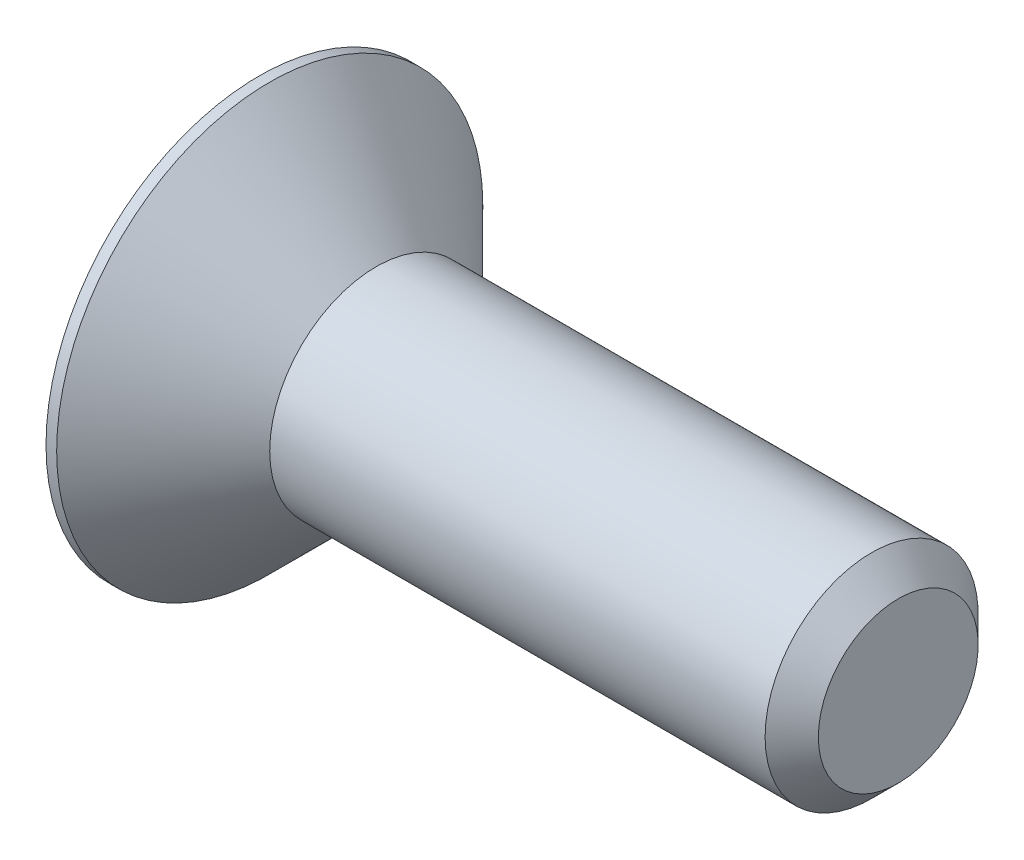
ISO-10303-21;
HEADER;
FILE_DESCRIPTION(('STEP AP214'),'2;1');
FILE_NAME('part.step','',(''),(''),'','','');
FILE_SCHEMA(('AUTOMOTIVE_DESIGN { 1 0 10303 214 1 1 1 1 }'));
ENDSEC;
DATA;
#1=APPLICATION_CONTEXT('core data for automotive mechanical design processes');
#2=APPLICATION_PROTOCOL_DEFINITION('international standard','automotive_design',2000,#1);
#3=PRODUCT_CONTEXT('',#1,'mechanical');
#4=PRODUCT('Part','Part','',(#3));
#5=PRODUCT_RELATED_PRODUCT_CATEGORY('part','',(#4));
#6=PRODUCT_DEFINITION_FORMATION('','',#4);
#7=PRODUCT_DEFINITION_CONTEXT('part definition',#1,'design');
#8=PRODUCT_DEFINITION('design','',#6,#7);
#9=PRODUCT_DEFINITION_SHAPE('','',#8);
#10=(LENGTH_UNIT() NAMED_UNIT(*) SI_UNIT(.MILLI.,.METRE.));
#11=(NAMED_UNIT(*) PLANE_ANGLE_UNIT() SI_UNIT($,.RADIAN.));
#12=(NAMED_UNIT(*) SI_UNIT($,.STERADIAN.) SOLID_ANGLE_UNIT());
#13=UNCERTAINTY_MEASURE_WITH_UNIT(LENGTH_MEASURE(1.E-05),#10,'distance_accuracy_value','');
#14=(GEOMETRIC_REPRESENTATION_CONTEXT(3) GLOBAL_UNCERTAINTY_ASSIGNED_CONTEXT((#13)) GLOBAL_UNIT_ASSIGNED_CONTEXT((#10,
#11,#12)) REPRESENTATION_CONTEXT('',''));
#15=CARTESIAN_POINT('',(0.,0.,0.));
#16=DIRECTION('',(0.,0.,1.));
#17=DIRECTION('',(1.,0.,0.));
#18=AXIS2_PLACEMENT_3D('',#15,#16,#17);
#19=CARTESIAN_POINT('',(0.,0.,0.));
#20=DIRECTION('',(1.,0.,0.));
#21=DIRECTION('',(0.,0.,-1.));
#22=AXIS2_PLACEMENT_3D('',#19,#20,#21);
#23=PLANE('',#22);
#24=DIRECTION('',(0.,0.866025403784439,0.5));
#25=VECTOR('',#24,1.);
#26=CARTESIAN_POINT('',(0.,-0.75,0.433012701892219));
#27=LINE('',#26,#25);
#28=CARTESIAN_POINT('',(0.,-0.75,0.433012701892219));
#29=VERTEX_POINT('',#28);
#30=CARTESIAN_POINT('',(0.,0.,0.866025403784438));
#31=VERTEX_POINT('',#30);
#32=EDGE_CURVE('E122',#29,#31,#27,.T.);
#33=ORIENTED_EDGE('',*,*,#32,.F.);
#34=DIRECTION('',(0.,0.,1.));
#35=VECTOR('',#34,1.);
#36=CARTESIAN_POINT('',(0.,-0.75,-0.43301270189222));
#37=LINE('',#36,#35);
#38=CARTESIAN_POINT('',(0.,-0.75,-0.43301270189222));
#39=VERTEX_POINT('',#38);
#40=EDGE_CURVE('E48',#39,#29,#37,.T.);
#41=ORIENTED_EDGE('',*,*,#40,.F.);
#42=DIRECTION('',(0.,-0.866025403784439,0.5));
#43=VECTOR('',#42,1.);
#44=CARTESIAN_POINT('',(0.,0.,-0.866025403784439));
#45=LINE('',#44,#43);
#46=CARTESIAN_POINT('',(0.,0.,-0.866025403784439));
#47=VERTEX_POINT('',#46);
#48=EDGE_CURVE('E131',#47,#39,#45,.T.);
#49=ORIENTED_EDGE('',*,*,#48,.F.);
#50=DIRECTION('',(0.,-0.866025403784439,-0.5));
#51=VECTOR('',#50,1.);
#52=CARTESIAN_POINT('',(0.,0.75,-0.43301270189222));
#53=LINE('',#52,#51);
#54=CARTESIAN_POINT('',(0.,0.75,-0.43301270189222));
#55=VERTEX_POINT('',#54);
#56=EDGE_CURVE('E129',#55,#47,#53,.T.);
#57=ORIENTED_EDGE('',*,*,#56,.F.);
#58=DIRECTION('',(0.,0.,-1.));
#59=VECTOR('',#58,1.);
#60=CARTESIAN_POINT('',(0.,0.75,0.433012701892219));
#61=LINE('',#60,#59);
#62=CARTESIAN_POINT('',(0.,0.75,0.433012701892219));
#63=VERTEX_POINT('',#62);
#64=EDGE_CURVE('E96',#63,#55,#61,.T.);
#65=ORIENTED_EDGE('',*,*,#64,.F.);
#66=DIRECTION('',(0.,0.866025403784439,-0.5));
#67=VECTOR('',#66,1.);
#68=CARTESIAN_POINT('',(0.,0.,0.866025403784438));
#69=LINE('',#68,#67);
#70=EDGE_CURVE('E125',#31,#63,#69,.T.);
#71=ORIENTED_EDGE('',*,*,#70,.F.);
#72=EDGE_LOOP('',(#33,#41,#49,#57,#65,#71));
#73=FACE_BOUND('',#72,.T.);
#74=CARTESIAN_POINT('',(0.,0.,0.));
#75=DIRECTION('',(-1.,0.,0.));
#76=DIRECTION('',(0.,0.,1.));
#77=AXIS2_PLACEMENT_3D('',#74,#75,#76);
#78=CIRCLE('',#77,2.);
#79=CARTESIAN_POINT('',(0.,0.,2.));
#80=VERTEX_POINT('',#79);
#81=EDGE_CURVE('E11',#80,#80,#78,.T.);
#82=ORIENTED_EDGE('',*,*,#81,.T.);
#83=EDGE_LOOP('',(#82));
#84=FACE_BOUND('',#83,.T.);
#85=ADVANCED_FACE('F34',(#73,#84),#23,.F.);
#86=CARTESIAN_POINT('',(-2.28184155946539,0.,0.));
#87=DIRECTION('',(-1.,0.,0.));
#88=DIRECTION('',(0.,0.,1.));
#89=AXIS2_PLACEMENT_3D('',#86,#87,#88);
#90=CYLINDRICAL_SURFACE('',#89,2.);
#91=ORIENTED_EDGE('',*,*,#81,.F.);
#92=EDGE_LOOP('',(#91));
#93=FACE_BOUND('',#92,.T.);
#94=CARTESIAN_POINT('',(0.0999999999999998,0.,0.));
#95=DIRECTION('',(-1.,0.,0.));
#96=DIRECTION('',(0.,0.,1.));
#97=AXIS2_PLACEMENT_3D('',#94,#95,#96);
#98=CIRCLE('',#97,2.);
#99=CARTESIAN_POINT('',(0.0999999999999998,0.,2.));
#100=VERTEX_POINT('',#99);
#101=EDGE_CURVE('E41',#100,#100,#98,.T.);
#102=ORIENTED_EDGE('',*,*,#101,.T.);
#103=EDGE_LOOP('',(#102));
#104=FACE_BOUND('',#103,.T.);
#105=ADVANCED_FACE('F151',(#93,#104),#90,.T.);
#106=CARTESIAN_POINT('',(1.1,0.,0.));
#107=DIRECTION('',(-1.,0.,0.));
#108=DIRECTION('',(0.,0.,1.));
#109=AXIS2_PLACEMENT_3D('',#106,#107,#108);
#110=CONICAL_SURFACE('',#109,1.,0.78539816339745);
#111=ORIENTED_EDGE('',*,*,#101,.F.);
#112=EDGE_LOOP('',(#111));
#113=FACE_BOUND('',#112,.T.);
#114=CARTESIAN_POINT('',(1.1,0.,0.));
#115=DIRECTION('',(-1.,0.,0.));
#116=DIRECTION('',(0.,0.,1.));
#117=AXIS2_PLACEMENT_3D('',#114,#115,#116);
#118=CIRCLE('',#117,1.);
#119=CARTESIAN_POINT('',(1.1,0.,1.));
#120=VERTEX_POINT('',#119);
#121=EDGE_CURVE('E146',#120,#120,#118,.T.);
#122=ORIENTED_EDGE('',*,*,#121,.T.);
#123=EDGE_LOOP('',(#122));
#124=FACE_BOUND('',#123,.T.);
#125=ADVANCED_FACE('F153',(#113,#124),#110,.T.);
#126=CARTESIAN_POINT('',(-2.28184155946539,0.,0.));
#127=DIRECTION('',(-1.,0.,0.));
#128=DIRECTION('',(0.,0.,1.));
#129=AXIS2_PLACEMENT_3D('',#126,#127,#128);
#130=CYLINDRICAL_SURFACE('',#129,1.);
#131=ORIENTED_EDGE('',*,*,#121,.F.);
#132=EDGE_LOOP('',(#131));
#133=FACE_BOUND('',#132,.T.);
#134=CARTESIAN_POINT('',(5.75,0.,0.));
#135=DIRECTION('',(-1.,0.,0.));
#136=DIRECTION('',(0.,0.,1.));
#137=AXIS2_PLACEMENT_3D('',#134,#135,#136);
#138=CIRCLE('',#137,1.);
#139=CARTESIAN_POINT('',(5.75,0.,1.));
#140=VERTEX_POINT('',#139);
#141=EDGE_CURVE('E143',#140,#140,#138,.T.);
#142=ORIENTED_EDGE('',*,*,#141,.T.);
#143=EDGE_LOOP('',(#142));
#144=FACE_BOUND('',#143,.T.);
#145=ADVANCED_FACE('F156',(#133,#144),#130,.T.);
#146=CARTESIAN_POINT('',(6.,0.,0.));
#147=DIRECTION('',(-1.,0.,0.));
#148=DIRECTION('',(0.,0.,1.));
#149=AXIS2_PLACEMENT_3D('',#146,#147,#148);
#150=CONICAL_SURFACE('',#149,0.75,0.785398163397448);
#151=ORIENTED_EDGE('',*,*,#141,.F.);
#152=EDGE_LOOP('',(#151));
#153=FACE_BOUND('',#152,.T.);
#154=CARTESIAN_POINT('',(6.,0.,0.));
#155=DIRECTION('',(-1.,0.,0.));
#156=DIRECTION('',(0.,0.,1.));
#157=AXIS2_PLACEMENT_3D('',#154,#155,#156);
#158=CIRCLE('',#157,0.75);
#159=CARTESIAN_POINT('',(6.,0.,0.75));
#160=VERTEX_POINT('',#159);
#161=EDGE_CURVE('E135',#160,#160,#158,.T.);
#162=ORIENTED_EDGE('',*,*,#161,.T.);
#163=EDGE_LOOP('',(#162));
#164=FACE_BOUND('',#163,.T.);
#165=ADVANCED_FACE('F162',(#153,#164),#150,.T.);
#166=CARTESIAN_POINT('',(6.,0.75,0.));
#167=DIRECTION('',(-1.,0.,0.));
#168=DIRECTION('',(0.,0.,1.));
#169=AXIS2_PLACEMENT_3D('',#166,#167,#168);
#170=PLANE('',#169);
#171=ORIENTED_EDGE('',*,*,#161,.F.);
#172=EDGE_LOOP('',(#171));
#173=FACE_BOUND('',#172,.T.);
#174=ADVANCED_FACE('F168',(#173),#170,.F.);
#175=CARTESIAN_POINT('',(0.8,-0.75,-0.43301270189222));
#176=DIRECTION('',(0.,-1.,0.));
#177=DIRECTION('',(0.,0.,-1.));
#178=AXIS2_PLACEMENT_3D('',#175,#176,#177);
#179=PLANE('',#178);
#180=ORIENTED_EDGE('',*,*,#40,.T.);
#181=DIRECTION('',(-1.,0.,0.));
#182=VECTOR('',#181,1.);
#183=CARTESIAN_POINT('',(0.8,-0.75,0.433012701892219));
#184=LINE('',#183,#182);
#185=CARTESIAN_POINT('',(0.8,-0.75,0.433012701892219));
#186=VERTEX_POINT('',#185);
#187=EDGE_CURVE('E78',#186,#29,#184,.T.);
#188=ORIENTED_EDGE('',*,*,#187,.F.);
#189=DIRECTION('',(0.,0.,1.));
#190=VECTOR('',#189,1.);
#191=CARTESIAN_POINT('',(0.8,-0.75,-0.43301270189222));
#192=LINE('',#191,#190);
#193=CARTESIAN_POINT('',(0.8,-0.75,-0.43301270189222));
#194=VERTEX_POINT('',#193);
#195=EDGE_CURVE('E133',#194,#186,#192,.T.);
#196=ORIENTED_EDGE('',*,*,#195,.F.);
#197=DIRECTION('',(-1.,0.,0.));
#198=VECTOR('',#197,1.);
#199=CARTESIAN_POINT('',(0.8,-0.75,-0.43301270189222));
#200=LINE('',#199,#198);
#201=EDGE_CURVE('E56',#194,#39,#200,.T.);
#202=ORIENTED_EDGE('',*,*,#201,.T.);
#203=EDGE_LOOP('',(#180,#188,#196,#202));
#204=FACE_BOUND('',#203,.T.);
#205=ADVANCED_FACE('F173',(#204),#179,.F.);
#206=CARTESIAN_POINT('',(0.8,0.,-0.866025403784439));
#207=DIRECTION('',(0.,-0.5,-0.866025403784439));
#208=DIRECTION('',(0.,0.866025403784439,-0.5));
#209=AXIS2_PLACEMENT_3D('',#206,#207,#208);
#210=PLANE('',#209);
#211=ORIENTED_EDGE('',*,*,#48,.T.);
#212=ORIENTED_EDGE('',*,*,#201,.F.);
#213=DIRECTION('',(0.,-0.866025403784439,0.5));
#214=VECTOR('',#213,1.);
#215=CARTESIAN_POINT('',(0.8,0.,-0.866025403784439));
#216=LINE('',#215,#214);
#217=CARTESIAN_POINT('',(0.8,0.,-0.866025403784439));
#218=VERTEX_POINT('',#217);
#219=EDGE_CURVE('E108',#218,#194,#216,.T.);
#220=ORIENTED_EDGE('',*,*,#219,.F.);
#221=DIRECTION('',(-1.,0.,0.));
#222=VECTOR('',#221,1.);
#223=CARTESIAN_POINT('',(0.8,0.,-0.866025403784439));
#224=LINE('',#223,#222);
#225=EDGE_CURVE('E100',#218,#47,#224,.T.);
#226=ORIENTED_EDGE('',*,*,#225,.T.);
#227=EDGE_LOOP('',(#211,#212,#220,#226));
#228=FACE_BOUND('',#227,.T.);
#229=ADVANCED_FACE('F178',(#228),#210,.F.);
#230=CARTESIAN_POINT('',(0.8,0.75,-0.43301270189222));
#231=DIRECTION('',(0.,0.5,-0.866025403784439));
#232=DIRECTION('',(0.,0.866025403784439,0.5));
#233=AXIS2_PLACEMENT_3D('',#230,#231,#232);
#234=PLANE('',#233);
#235=ORIENTED_EDGE('',*,*,#56,.T.);
#236=ORIENTED_EDGE('',*,*,#225,.F.);
#237=DIRECTION('',(0.,-0.866025403784439,-0.5));
#238=VECTOR('',#237,1.);
#239=CARTESIAN_POINT('',(0.8,0.75,-0.43301270189222));
#240=LINE('',#239,#238);
#241=CARTESIAN_POINT('',(0.8,0.75,-0.43301270189222));
#242=VERTEX_POINT('',#241);
#243=EDGE_CURVE('E104',#242,#218,#240,.T.);
#244=ORIENTED_EDGE('',*,*,#243,.F.);
#245=DIRECTION('',(-1.,0.,0.));
#246=VECTOR('',#245,1.);
#247=CARTESIAN_POINT('',(0.8,0.75,-0.43301270189222));
#248=LINE('',#247,#246);
#249=EDGE_CURVE('E89',#242,#55,#248,.T.);
#250=ORIENTED_EDGE('',*,*,#249,.T.);
#251=EDGE_LOOP('',(#235,#236,#244,#250));
#252=FACE_BOUND('',#251,.T.);
#253=ADVANCED_FACE('F105',(#252),#234,.F.);
#254=CARTESIAN_POINT('',(0.8,0.75,0.433012701892219));
#255=DIRECTION('',(0.,1.,0.));
#256=DIRECTION('',(0.,0.,1.));
#257=AXIS2_PLACEMENT_3D('',#254,#255,#256);
#258=PLANE('',#257);
#259=ORIENTED_EDGE('',*,*,#64,.T.);
#260=ORIENTED_EDGE('',*,*,#249,.F.);
#261=DIRECTION('',(0.,0.,-1.));
#262=VECTOR('',#261,1.);
#263=CARTESIAN_POINT('',(0.8,0.75,0.433012701892219));
#264=LINE('',#263,#262);
#265=CARTESIAN_POINT('',(0.8,0.75,0.433012701892219));
#266=VERTEX_POINT('',#265);
#267=EDGE_CURVE('E93',#266,#242,#264,.T.);
#268=ORIENTED_EDGE('',*,*,#267,.F.);
#269=DIRECTION('',(-1.,0.,0.));
#270=VECTOR('',#269,1.);
#271=CARTESIAN_POINT('',(0.8,0.75,0.433012701892219));
#272=LINE('',#271,#270);
#273=EDGE_CURVE('E101',#266,#63,#272,.T.);
#274=ORIENTED_EDGE('',*,*,#273,.T.);
#275=EDGE_LOOP('',(#259,#260,#268,#274));
#276=FACE_BOUND('',#275,.T.);
#277=ADVANCED_FACE('F91',(#276),#258,.F.);
#278=CARTESIAN_POINT('',(0.8,0.,0.866025403784438));
#279=DIRECTION('',(0.,0.5,0.866025403784439));
#280=DIRECTION('',(0.,-0.866025403784439,0.5));
#281=AXIS2_PLACEMENT_3D('',#278,#279,#280);
#282=PLANE('',#281);
#283=ORIENTED_EDGE('',*,*,#70,.T.);
#284=ORIENTED_EDGE('',*,*,#273,.F.);
#285=DIRECTION('',(0.,0.866025403784439,-0.5));
#286=VECTOR('',#285,1.);
#287=CARTESIAN_POINT('',(0.8,0.,0.866025403784438));
#288=LINE('',#287,#286);
#289=CARTESIAN_POINT('',(0.8,0.,0.866025403784438));
#290=VERTEX_POINT('',#289);
#291=EDGE_CURVE('E114',#290,#266,#288,.T.);
#292=ORIENTED_EDGE('',*,*,#291,.F.);
#293=DIRECTION('',(-1.,0.,0.));
#294=VECTOR('',#293,1.);
#295=CARTESIAN_POINT('',(0.8,0.,0.866025403784438));
#296=LINE('',#295,#294);
#297=EDGE_CURVE('E138',#290,#31,#296,.T.);
#298=ORIENTED_EDGE('',*,*,#297,.T.);
#299=EDGE_LOOP('',(#283,#284,#292,#298));
#300=FACE_BOUND('',#299,.T.);
#301=ADVANCED_FACE('F204',(#300),#282,.F.);
#302=CARTESIAN_POINT('',(0.8,-0.75,0.433012701892219));
#303=DIRECTION('',(0.,-0.5,0.866025403784439));
#304=DIRECTION('',(0.,-0.866025403784439,-0.5));
#305=AXIS2_PLACEMENT_3D('',#302,#303,#304);
#306=PLANE('',#305);
#307=ORIENTED_EDGE('',*,*,#32,.T.);
#308=ORIENTED_EDGE('',*,*,#297,.F.);
#309=DIRECTION('',(0.,0.866025403784439,0.5));
#310=VECTOR('',#309,1.);
#311=CARTESIAN_POINT('',(0.8,-0.75,0.433012701892219));
#312=LINE('',#311,#310);
#313=EDGE_CURVE('E116',#186,#290,#312,.T.);
#314=ORIENTED_EDGE('',*,*,#313,.F.);
#315=ORIENTED_EDGE('',*,*,#187,.T.);
#316=EDGE_LOOP('',(#307,#308,#314,#315));
#317=FACE_BOUND('',#316,.T.);
#318=ADVANCED_FACE('F192',(#317),#306,.F.);
#319=CARTESIAN_POINT('',(0.8,0.,0.));
#320=DIRECTION('',(-1.,0.,0.));
#321=DIRECTION('',(0.,0.,1.));
#322=AXIS2_PLACEMENT_3D('',#319,#320,#321);
#323=PLANE('',#322);
#324=ORIENTED_EDGE('',*,*,#195,.T.);
#325=ORIENTED_EDGE('',*,*,#313,.T.);
#326=ORIENTED_EDGE('',*,*,#291,.T.);
#327=ORIENTED_EDGE('',*,*,#267,.T.);
#328=ORIENTED_EDGE('',*,*,#243,.T.);
#329=ORIENTED_EDGE('',*,*,#219,.T.);
#330=EDGE_LOOP('',(#324,#325,#326,#327,#328,#329));
#331=FACE_BOUND('',#330,.T.);
#332=ADVANCED_FACE('F111',(#331),#323,.T.);
#333=CLOSED_SHELL('',(#85,#105,#125,#145,#165,#174,#205,#229,#253,#277,#301,#318,#332));
#334=MANIFOLD_SOLID_BREP('B2',#333);
#335=ADVANCED_BREP_SHAPE_REPRESENTATION('',(#18,#334),#14);
#336=SHAPE_DEFINITION_REPRESENTATION(#9,#335);
ENDSEC;
END-ISO-10303-21;
